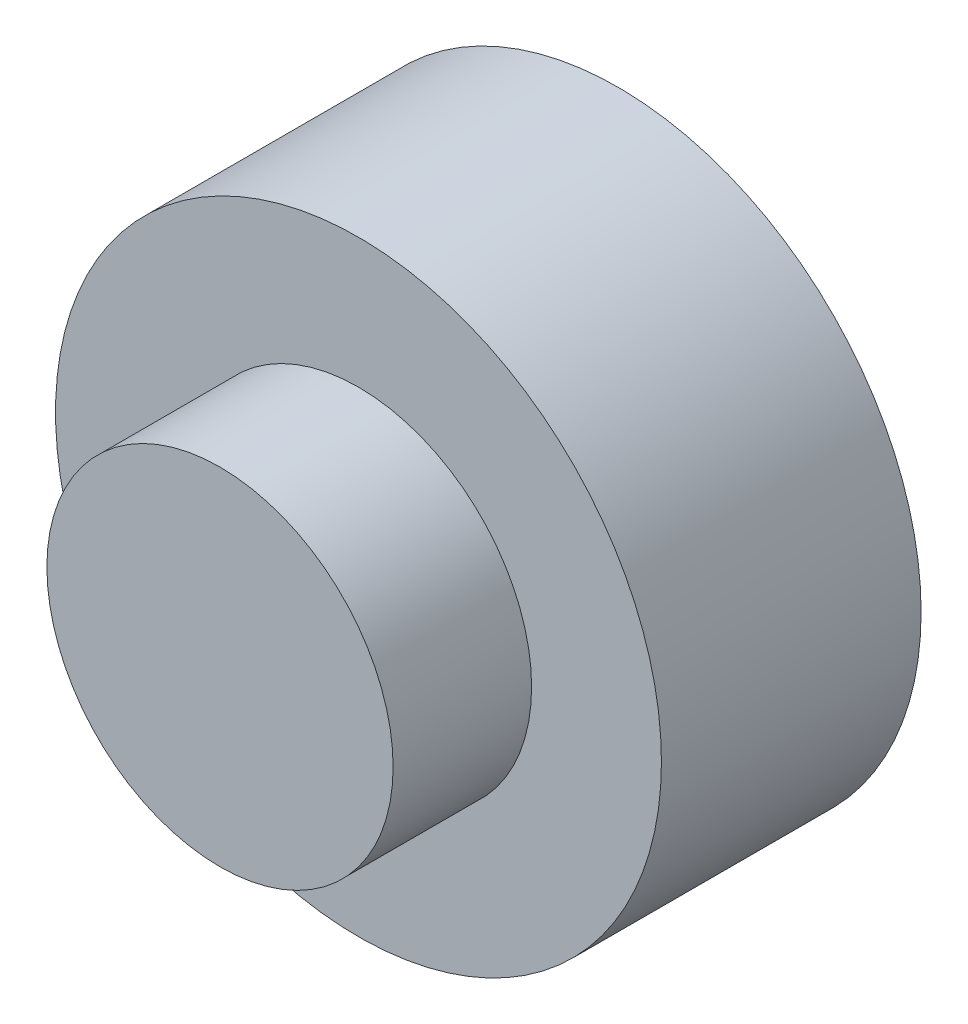
ISO-10303-21;
HEADER;
FILE_DESCRIPTION(('STEP AP214'),'2;1');
FILE_NAME('part.step','',(''),(''),'','','');
FILE_SCHEMA(('AUTOMOTIVE_DESIGN { 1 0 10303 214 1 1 1 1 }'));
ENDSEC;
DATA;
#1=APPLICATION_CONTEXT('core data for automotive mechanical design processes');
#2=APPLICATION_PROTOCOL_DEFINITION('international standard','automotive_design',2000,#1);
#3=PRODUCT_CONTEXT('',#1,'mechanical');
#4=PRODUCT('Part','Part','',(#3));
#5=PRODUCT_RELATED_PRODUCT_CATEGORY('part','',(#4));
#6=PRODUCT_DEFINITION_FORMATION('','',#4);
#7=PRODUCT_DEFINITION_CONTEXT('part definition',#1,'design');
#8=PRODUCT_DEFINITION('design','',#6,#7);
#9=PRODUCT_DEFINITION_SHAPE('','',#8);
#10=(LENGTH_UNIT() NAMED_UNIT(*) SI_UNIT(.MILLI.,.METRE.));
#11=(NAMED_UNIT(*) PLANE_ANGLE_UNIT() SI_UNIT($,.RADIAN.));
#12=(NAMED_UNIT(*) SI_UNIT($,.STERADIAN.) SOLID_ANGLE_UNIT());
#13=UNCERTAINTY_MEASURE_WITH_UNIT(LENGTH_MEASURE(1.E-05),#10,'distance_accuracy_value','');
#14=(GEOMETRIC_REPRESENTATION_CONTEXT(3) GLOBAL_UNCERTAINTY_ASSIGNED_CONTEXT((#13)) GLOBAL_UNIT_ASSIGNED_CONTEXT((#10,
#11,#12)) REPRESENTATION_CONTEXT('',''));
#15=CARTESIAN_POINT('',(0.,0.,0.));
#16=DIRECTION('',(0.,0.,1.));
#17=DIRECTION('',(1.,0.,0.));
#18=AXIS2_PLACEMENT_3D('',#15,#16,#17);
#19=CARTESIAN_POINT('',(0.,0.,15.));
#20=DIRECTION('',(0.,0.,-1.));
#21=DIRECTION('',(-1.,0.,0.));
#22=AXIS2_PLACEMENT_3D('',#19,#20,#21);
#23=CYLINDRICAL_SURFACE('',#22,17.5);
#24=CARTESIAN_POINT('',(0.,0.,15.));
#25=DIRECTION('',(0.,0.,1.));
#26=DIRECTION('',(1.,0.,0.));
#27=AXIS2_PLACEMENT_3D('',#24,#25,#26);
#28=CIRCLE('',#27,17.5);
#29=CARTESIAN_POINT('',(17.5,0.,15.));
#30=VERTEX_POINT('',#29);
#31=EDGE_CURVE('E10',#30,#30,#28,.T.);
#32=ORIENTED_EDGE('',*,*,#31,.F.);
#33=EDGE_LOOP('',(#32));
#34=FACE_BOUND('',#33,.T.);
#35=CARTESIAN_POINT('',(0.,0.,0.));
#36=DIRECTION('',(0.,0.,1.));
#37=DIRECTION('',(1.,0.,0.));
#38=AXIS2_PLACEMENT_3D('',#35,#36,#37);
#39=CIRCLE('',#38,17.5);
#40=CARTESIAN_POINT('',(17.5,0.,0.));
#41=VERTEX_POINT('',#40);
#42=EDGE_CURVE('E34',#41,#41,#39,.T.);
#43=ORIENTED_EDGE('',*,*,#42,.T.);
#44=EDGE_LOOP('',(#43));
#45=FACE_BOUND('',#44,.T.);
#46=ADVANCED_FACE('F31',(#34,#45),#23,.T.);
#47=CARTESIAN_POINT('',(0.,0.,15.));
#48=DIRECTION('',(0.,0.,1.));
#49=DIRECTION('',(1.,0.,0.));
#50=AXIS2_PLACEMENT_3D('',#47,#48,#49);
#51=PLANE('',#50);
#52=CARTESIAN_POINT('',(0.,0.,15.));
#53=DIRECTION('',(0.,0.,1.));
#54=DIRECTION('',(1.,0.,0.));
#55=AXIS2_PLACEMENT_3D('',#52,#53,#54);
#56=CIRCLE('',#55,10.);
#57=CARTESIAN_POINT('',(10.,0.,15.));
#58=VERTEX_POINT('',#57);
#59=EDGE_CURVE('E43',#58,#58,#56,.T.);
#60=ORIENTED_EDGE('',*,*,#59,.F.);
#61=EDGE_LOOP('',(#60));
#62=FACE_BOUND('',#61,.T.);
#63=ORIENTED_EDGE('',*,*,#31,.T.);
#64=EDGE_LOOP('',(#63));
#65=FACE_BOUND('',#64,.T.);
#66=ADVANCED_FACE('F58',(#62,#65),#51,.T.);
#67=CARTESIAN_POINT('',(0.,0.,0.));
#68=DIRECTION('',(0.,0.,1.));
#69=DIRECTION('',(1.,0.,0.));
#70=AXIS2_PLACEMENT_3D('',#67,#68,#69);
#71=PLANE('',#70);
#72=ORIENTED_EDGE('',*,*,#42,.F.);
#73=EDGE_LOOP('',(#72));
#74=FACE_BOUND('',#73,.T.);
#75=ADVANCED_FACE('F54',(#74),#71,.F.);
#76=CARTESIAN_POINT('',(0.,0.,23.));
#77=DIRECTION('',(0.,0.,-1.));
#78=DIRECTION('',(-1.,0.,0.));
#79=AXIS2_PLACEMENT_3D('',#76,#77,#78);
#80=CYLINDRICAL_SURFACE('',#79,10.);
#81=CARTESIAN_POINT('',(0.,0.,23.));
#82=DIRECTION('',(0.,0.,1.));
#83=DIRECTION('',(1.,0.,0.));
#84=AXIS2_PLACEMENT_3D('',#81,#82,#83);
#85=CIRCLE('',#84,10.);
#86=CARTESIAN_POINT('',(10.,0.,23.));
#87=VERTEX_POINT('',#86);
#88=EDGE_CURVE('E41',#87,#87,#85,.T.);
#89=ORIENTED_EDGE('',*,*,#88,.F.);
#90=EDGE_LOOP('',(#89));
#91=FACE_BOUND('',#90,.T.);
#92=ORIENTED_EDGE('',*,*,#59,.T.);
#93=EDGE_LOOP('',(#92));
#94=FACE_BOUND('',#93,.T.);
#95=ADVANCED_FACE('F51',(#91,#94),#80,.T.);
#96=CARTESIAN_POINT('',(0.,0.,23.));
#97=DIRECTION('',(0.,0.,1.));
#98=DIRECTION('',(1.,0.,0.));
#99=AXIS2_PLACEMENT_3D('',#96,#97,#98);
#100=PLANE('',#99);
#101=ORIENTED_EDGE('',*,*,#88,.T.);
#102=EDGE_LOOP('',(#101));
#103=FACE_BOUND('',#102,.T.);
#104=ADVANCED_FACE('F49',(#103),#100,.T.);
#105=CLOSED_SHELL('',(#46,#66,#75,#95,#104));
#106=MANIFOLD_SOLID_BREP('B2',#105);
#107=ADVANCED_BREP_SHAPE_REPRESENTATION('',(#18,#106),#14);
#108=SHAPE_DEFINITION_REPRESENTATION(#9,#107);
ENDSEC;
END-ISO-10303-21;
